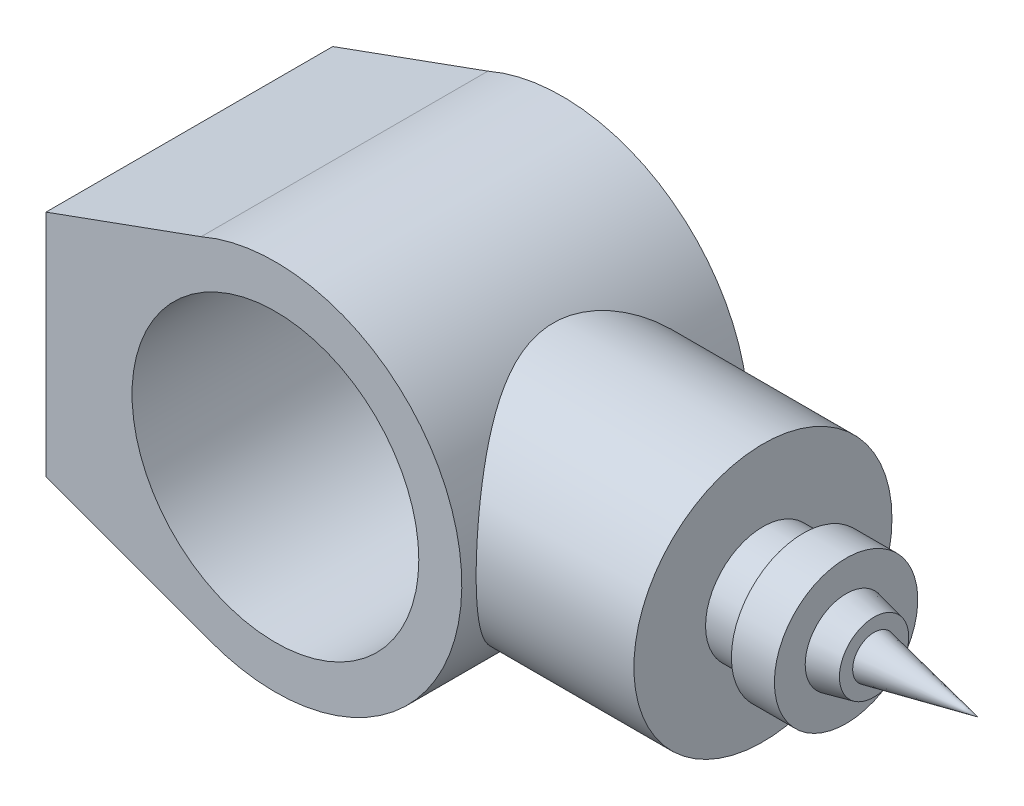
ISO-10303-21;
HEADER;
FILE_DESCRIPTION(('STEP AP214'),'2;1');
FILE_NAME('part.step','',(''),(''),'','','');
FILE_SCHEMA(('AUTOMOTIVE_DESIGN { 1 0 10303 214 1 1 1 1 }'));
ENDSEC;
DATA;
#1=APPLICATION_CONTEXT('core data for automotive mechanical design processes');
#2=APPLICATION_PROTOCOL_DEFINITION('international standard','automotive_design',2000,#1);
#3=PRODUCT_CONTEXT('',#1,'mechanical');
#4=PRODUCT('Part','Part','',(#3));
#5=PRODUCT_RELATED_PRODUCT_CATEGORY('part','',(#4));
#6=PRODUCT_DEFINITION_FORMATION('','',#4);
#7=PRODUCT_DEFINITION_CONTEXT('part definition',#1,'design');
#8=PRODUCT_DEFINITION('design','',#6,#7);
#9=PRODUCT_DEFINITION_SHAPE('','',#8);
#10=(LENGTH_UNIT() NAMED_UNIT(*) SI_UNIT(.MILLI.,.METRE.));
#11=(NAMED_UNIT(*) PLANE_ANGLE_UNIT() SI_UNIT($,.RADIAN.));
#12=(NAMED_UNIT(*) SI_UNIT($,.STERADIAN.) SOLID_ANGLE_UNIT());
#13=UNCERTAINTY_MEASURE_WITH_UNIT(LENGTH_MEASURE(1.E-05),#10,'distance_accuracy_value','');
#14=(GEOMETRIC_REPRESENTATION_CONTEXT(3) GLOBAL_UNCERTAINTY_ASSIGNED_CONTEXT((#13)) GLOBAL_UNIT_ASSIGNED_CONTEXT((#10,
#11,#12)) REPRESENTATION_CONTEXT('',''));
#15=CARTESIAN_POINT('',(0.,0.,0.));
#16=DIRECTION('',(0.,0.,1.));
#17=DIRECTION('',(1.,0.,0.));
#18=AXIS2_PLACEMENT_3D('',#15,#16,#17);
#19=CARTESIAN_POINT('',(0.,0.,50.));
#20=DIRECTION('',(0.,0.,1.));
#21=DIRECTION('',(1.,0.,0.));
#22=AXIS2_PLACEMENT_3D('',#19,#20,#21);
#23=PLANE('',#22);
#24=DIRECTION('',(-0.94010876807372,-0.340874616524774,0.));
#25=VECTOR('',#24,1.);
#26=CARTESIAN_POINT('',(-80.,40.,50.));
#27=LINE('',#26,#25);
#28=CARTESIAN_POINT('',(-25.9121645886203,59.6117415140025,50.));
#29=VERTEX_POINT('',#28);
#30=CARTESIAN_POINT('',(-80.,40.,50.));
#31=VERTEX_POINT('',#30);
#32=EDGE_CURVE('E179',#29,#31,#27,.T.);
#33=ORIENTED_EDGE('',*,*,#32,.T.);
#34=DIRECTION('',(0.,-1.,0.));
#35=VECTOR('',#34,1.);
#36=CARTESIAN_POINT('',(-80.,-40.,50.));
#37=LINE('',#36,#35);
#38=CARTESIAN_POINT('',(-80.,-40.,50.));
#39=VERTEX_POINT('',#38);
#40=EDGE_CURVE('E81',#31,#39,#37,.T.);
#41=ORIENTED_EDGE('',*,*,#40,.T.);
#42=DIRECTION('',(0.939431565550324,-0.342736536785424,0.));
#43=VECTOR('',#42,1.);
#44=CARTESIAN_POINT('',(-80.,-40.,50.));
#45=LINE('',#44,#43);
#46=CARTESIAN_POINT('',(-22.9380914935134,-60.8181219591267,50.));
#47=VERTEX_POINT('',#46);
#48=EDGE_CURVE('E175',#39,#47,#45,.T.);
#49=ORIENTED_EDGE('',*,*,#48,.T.);
#50=CARTESIAN_POINT('',(0.,0.,50.));
#51=DIRECTION('',(0.,0.,1.));
#52=DIRECTION('',(1.,0.,0.));
#53=AXIS2_PLACEMENT_3D('',#50,#51,#52);
#54=CIRCLE('',#53,65.);
#55=EDGE_CURVE('E50',#47,#29,#54,.T.);
#56=ORIENTED_EDGE('',*,*,#55,.T.);
#57=EDGE_LOOP('',(#33,#41,#49,#56));
#58=FACE_BOUND('',#57,.T.);
#59=CARTESIAN_POINT('',(0.,0.,50.));
#60=DIRECTION('',(0.,0.,1.));
#61=DIRECTION('',(1.,0.,0.));
#62=AXIS2_PLACEMENT_3D('',#59,#60,#61);
#63=CIRCLE('',#62,50.);
#64=CARTESIAN_POINT('',(50.,0.,50.));
#65=VERTEX_POINT('',#64);
#66=EDGE_CURVE('E189',#65,#65,#63,.T.);
#67=ORIENTED_EDGE('',*,*,#66,.F.);
#68=EDGE_LOOP('',(#67));
#69=FACE_BOUND('',#68,.T.);
#70=ADVANCED_FACE('F33',(#58,#69),#23,.T.);
#71=CARTESIAN_POINT('',(0.,0.,-50.));
#72=DIRECTION('',(0.,0.,1.));
#73=DIRECTION('',(1.,0.,0.));
#74=AXIS2_PLACEMENT_3D('',#71,#72,#73);
#75=PLANE('',#74);
#76=DIRECTION('',(-0.94010876807372,-0.340874616524774,0.));
#77=VECTOR('',#76,1.);
#78=CARTESIAN_POINT('',(-80.,40.,-50.));
#79=LINE('',#78,#77);
#80=CARTESIAN_POINT('',(-25.9121645886203,59.6117415140025,-50.));
#81=VERTEX_POINT('',#80);
#82=CARTESIAN_POINT('',(-80.,40.,-50.));
#83=VERTEX_POINT('',#82);
#84=EDGE_CURVE('E173',#81,#83,#79,.T.);
#85=ORIENTED_EDGE('',*,*,#84,.F.);
#86=CARTESIAN_POINT('',(0.,0.,-50.));
#87=DIRECTION('',(0.,0.,1.));
#88=DIRECTION('',(1.,0.,0.));
#89=AXIS2_PLACEMENT_3D('',#86,#87,#88);
#90=CIRCLE('',#89,65.);
#91=CARTESIAN_POINT('',(-22.9380914935134,-60.8181219591267,-50.));
#92=VERTEX_POINT('',#91);
#93=EDGE_CURVE('E74',#92,#81,#90,.T.);
#94=ORIENTED_EDGE('',*,*,#93,.F.);
#95=DIRECTION('',(0.939431565550324,-0.342736536785424,0.));
#96=VECTOR('',#95,1.);
#97=CARTESIAN_POINT('',(-80.,-40.,-50.));
#98=LINE('',#97,#96);
#99=CARTESIAN_POINT('',(-80.,-40.,-50.));
#100=VERTEX_POINT('',#99);
#101=EDGE_CURVE('E68',#100,#92,#98,.T.);
#102=ORIENTED_EDGE('',*,*,#101,.F.);
#103=DIRECTION('',(0.,-1.,0.));
#104=VECTOR('',#103,1.);
#105=CARTESIAN_POINT('',(-80.,-40.,-50.));
#106=LINE('',#105,#104);
#107=EDGE_CURVE('E168',#83,#100,#106,.T.);
#108=ORIENTED_EDGE('',*,*,#107,.F.);
#109=EDGE_LOOP('',(#85,#94,#102,#108));
#110=FACE_BOUND('',#109,.T.);
#111=CARTESIAN_POINT('',(0.,0.,-50.));
#112=DIRECTION('',(0.,0.,1.));
#113=DIRECTION('',(1.,0.,0.));
#114=AXIS2_PLACEMENT_3D('',#111,#112,#113);
#115=CIRCLE('',#114,50.);
#116=CARTESIAN_POINT('',(50.,0.,-50.));
#117=VERTEX_POINT('',#116);
#118=EDGE_CURVE('E191',#117,#117,#115,.T.);
#119=ORIENTED_EDGE('',*,*,#118,.T.);
#120=EDGE_LOOP('',(#119));
#121=FACE_BOUND('',#120,.T.);
#122=ADVANCED_FACE('F148',(#110,#121),#75,.F.);
#123=CARTESIAN_POINT('',(-80.,40.,50.));
#124=DIRECTION('',(0.340874616524774,-0.940108768073721,0.));
#125=DIRECTION('',(0.94010876807372,0.340874616524774,0.));
#126=AXIS2_PLACEMENT_3D('',#123,#124,#125);
#127=PLANE('',#126);
#128=ORIENTED_EDGE('',*,*,#84,.T.);
#129=DIRECTION('',(0.,0.,-1.));
#130=VECTOR('',#129,1.);
#131=CARTESIAN_POINT('',(-80.,40.,50.));
#132=LINE('',#131,#130);
#133=EDGE_CURVE('E11',#31,#83,#132,.T.);
#134=ORIENTED_EDGE('',*,*,#133,.F.);
#135=ORIENTED_EDGE('',*,*,#32,.F.);
#136=DIRECTION('',(0.,0.,-1.));
#137=VECTOR('',#136,1.);
#138=CARTESIAN_POINT('',(-25.9121645886203,59.6117415140025,50.));
#139=LINE('',#138,#137);
#140=EDGE_CURVE('E183',#29,#81,#139,.T.);
#141=ORIENTED_EDGE('',*,*,#140,.T.);
#142=EDGE_LOOP('',(#128,#134,#135,#141));
#143=FACE_BOUND('',#142,.T.);
#144=ADVANCED_FACE('F35',(#143),#127,.F.);
#145=CARTESIAN_POINT('',(-80.,-40.,50.));
#146=DIRECTION('',(1.,0.,0.));
#147=DIRECTION('',(0.,1.,0.));
#148=AXIS2_PLACEMENT_3D('',#145,#146,#147);
#149=PLANE('',#148);
#150=ORIENTED_EDGE('',*,*,#107,.T.);
#151=DIRECTION('',(0.,0.,-1.));
#152=VECTOR('',#151,1.);
#153=CARTESIAN_POINT('',(-80.,-40.,50.));
#154=LINE('',#153,#152);
#155=EDGE_CURVE('E42',#39,#100,#154,.T.);
#156=ORIENTED_EDGE('',*,*,#155,.F.);
#157=ORIENTED_EDGE('',*,*,#40,.F.);
#158=ORIENTED_EDGE('',*,*,#133,.T.);
#159=EDGE_LOOP('',(#150,#156,#157,#158));
#160=FACE_BOUND('',#159,.T.);
#161=ADVANCED_FACE('F162',(#160),#149,.F.);
#162=CARTESIAN_POINT('',(-80.,-40.,50.));
#163=DIRECTION('',(0.342736536785424,0.939431565550324,0.));
#164=DIRECTION('',(-0.939431565550324,0.342736536785424,0.));
#165=AXIS2_PLACEMENT_3D('',#162,#163,#164);
#166=PLANE('',#165);
#167=ORIENTED_EDGE('',*,*,#101,.T.);
#168=DIRECTION('',(0.,0.,-1.));
#169=VECTOR('',#168,1.);
#170=CARTESIAN_POINT('',(-22.9380914935134,-60.8181219591267,50.));
#171=LINE('',#170,#169);
#172=EDGE_CURVE('E176',#47,#92,#171,.T.);
#173=ORIENTED_EDGE('',*,*,#172,.F.);
#174=ORIENTED_EDGE('',*,*,#48,.F.);
#175=ORIENTED_EDGE('',*,*,#155,.T.);
#176=EDGE_LOOP('',(#167,#173,#174,#175));
#177=FACE_BOUND('',#176,.T.);
#178=ADVANCED_FACE('F159',(#177),#166,.F.);
#179=CARTESIAN_POINT('',(0.,0.,50.));
#180=DIRECTION('',(0.,0.,-1.));
#181=DIRECTION('',(-1.,0.,0.));
#182=AXIS2_PLACEMENT_3D('',#179,#180,#181);
#183=CYLINDRICAL_SURFACE('',#182,65.);
#184=CARTESIAN_POINT('',(65.,0.,-45.));
#185=CARTESIAN_POINT('',(65.0000011696057,1.12147330120565,-45.0000012025283));
#186=CARTESIAN_POINT('',(64.9709159765212,2.24292945230778,-44.9580201602482));
#187=CARTESIAN_POINT('',(64.8553068641383,4.47658414079082,-44.790785609369));
#188=CARTESIAN_POINT('',(64.7687842573088,5.58878288911931,-44.6655340035371));
#189=CARTESIAN_POINT('',(64.5403785763001,7.79555151848628,-44.3336771879691));
#190=CARTESIAN_POINT('',(64.3984760503456,8.89011506447751,-44.1270433931238));
#191=CARTESIAN_POINT('',(64.0626457436966,11.0533096019768,-43.6354760134034));
#192=CARTESIAN_POINT('',(63.8687169569864,12.1219400915896,-43.3505409144375));
#193=CARTESIAN_POINT('',(63.4342222744662,14.2212125160505,-42.7078017297046));
#194=CARTESIAN_POINT('',(63.1938918545645,15.2520162370063,-42.3503651251477));
#195=CARTESIAN_POINT('',(62.6709259446924,17.2756280115286,-41.5659763086892));
#196=CARTESIAN_POINT('',(62.3882907364915,18.268436318107,-41.1390245597888));
#197=CARTESIAN_POINT('',(61.786108553932,20.2116697228795,-40.2199419970838));
#198=CARTESIAN_POINT('',(61.4665619062631,21.1620951960855,-39.7278117601444));
#199=CARTESIAN_POINT('',(60.7962171584065,23.0172309124314,-38.6825647509799));
#200=CARTESIAN_POINT('',(60.4454175300334,23.9219389167185,-38.1294449962195));
#201=CARTESIAN_POINT('',(59.6865648974474,25.7601880140228,-36.9151737617935));
#202=CARTESIAN_POINT('',(59.27618815402,26.6893215363404,-36.2488040005491));
#203=CARTESIAN_POINT('',(58.4330275057249,28.4880338622967,-34.8529502059224));
#204=CARTESIAN_POINT('',(58.0002425478181,29.3576098626539,-34.1234632053608));
#205=CARTESIAN_POINT('',(57.1195111836477,31.0364486388513,-32.6040251352403));
#206=CARTESIAN_POINT('',(56.6715447181891,31.8456267033451,-31.8139921794123));
#207=CARTESIAN_POINT('',(55.7691986061138,33.4006700551814,-30.1773036556993));
#208=CARTESIAN_POINT('',(55.3148185876119,34.1465316534289,-29.3306447936721));
#209=CARTESIAN_POINT('',(54.3303114345595,35.6959084068904,-27.4326466159468));
#210=CARTESIAN_POINT('',(53.8005937511269,36.4872853280241,-26.3711450656527));
#211=CARTESIAN_POINT('',(52.7593327891933,37.9773509509911,-24.17604025639));
#212=CARTESIAN_POINT('',(52.2477941160227,38.6760162868262,-23.0424189272517));
#213=CARTESIAN_POINT('',(51.2608149265043,39.9749077721744,-20.7072341856928));
#214=CARTESIAN_POINT('',(50.7853275075273,40.5752630453964,-19.5057627267967));
#215=CARTESIAN_POINT('',(49.8892399163793,41.6721166930025,-17.036931864064));
#216=CARTESIAN_POINT('',(49.4686114171658,42.1686687478853,-15.7696069409943));
#217=CARTESIAN_POINT('',(48.8208029416879,42.9149535309565,-13.5723996352816));
#218=CARTESIAN_POINT('',(48.5738420263557,43.1936925213245,-12.6581208440976));
#219=CARTESIAN_POINT('',(48.1238801744123,43.6944569649788,-10.8035389223551));
#220=CARTESIAN_POINT('',(47.9208721021929,43.9164916250901,-9.86324004407419));
#221=CARTESIAN_POINT('',(47.5660754926548,44.3005296261305,-7.96250438663409));
#222=CARTESIAN_POINT('',(47.4142038087044,44.4626304606427,-7.00210302149487));
#223=CARTESIAN_POINT('',(47.1671263845177,44.7246555122386,-5.06554052628518));
#224=CARTESIAN_POINT('',(47.0719206259529,44.824579749433,-4.08937940131224));
#225=CARTESIAN_POINT('',(46.9418899090943,44.9607388198673,-2.1232364847967));
#226=CARTESIAN_POINT('',(46.9073939345417,44.9966266570423,-1.13320851844658));
#227=CARTESIAN_POINT('',(46.9013571135476,45.0029190462422,0.847248377093852));
#228=CARTESIAN_POINT('',(46.9298161498631,44.9733237202183,1.837677305534));
#229=CARTESIAN_POINT('',(47.0484302849821,44.8492190899201,3.81128752429081));
#230=CARTESIAN_POINT('',(47.13862305521,44.7546701492421,4.79446401850661));
#231=CARTESIAN_POINT('',(47.3768313176079,44.5024241630868,6.74551496467455));
#232=CARTESIAN_POINT('',(47.5248480621437,44.3447257499009,7.71338908473168));
#233=CARTESIAN_POINT('',(47.8621764271841,43.9803320764262,9.56919366964684));
#234=CARTESIAN_POINT('',(48.0484149088864,43.7772163066585,10.4583970625519));
#235=CARTESIAN_POINT('',(48.4609441046406,43.32010640119,12.2144143492181));
#236=CARTESIAN_POINT('',(48.6872496045115,43.0660934784815,13.0812198417583));
#237=CARTESIAN_POINT('',(49.1738509640383,42.5096331932465,14.7898225666927));
#238=CARTESIAN_POINT('',(49.4341648638834,42.2071601049958,15.6316062329481));
#239=CARTESIAN_POINT('',(49.9825182796335,41.5563350032134,17.2876417419013));
#240=CARTESIAN_POINT('',(50.2705534011697,41.2079902580444,18.1018979206949));
#241=CARTESIAN_POINT('',(51.0225431471345,40.2767822129268,20.1137766396802));
#242=CARTESIAN_POINT('',(51.5007434523328,39.6654891440572,21.2930273345177));
#243=CARTESIAN_POINT('',(52.4891158781477,38.348029920852,23.5833678403921));
#244=CARTESIAN_POINT('',(52.9993005340589,37.6418264436726,24.6944305853524));
#245=CARTESIAN_POINT('',(54.0361557973494,36.1376496350166,26.8476775780095));
#246=CARTESIAN_POINT('',(54.5628535785461,35.3395185623559,27.8897384505711));
#247=CARTESIAN_POINT('',(55.6171804467178,33.6558443419671,29.8998791095632));
#248=CARTESIAN_POINT('',(56.1448094104418,32.7703120184234,30.8679680307498));
#249=CARTESIAN_POINT('',(57.1932449701135,30.9045304086319,32.7363921475659));
#250=CARTESIAN_POINT('',(57.7139191350983,29.9233731295192,33.6358963165067));
#251=CARTESIAN_POINT('',(58.7296419536465,27.8771206485979,35.350355349792));
#252=CARTESIAN_POINT('',(59.2246882700661,26.8120178135979,36.1653025097018));
#253=CARTESIAN_POINT('',(60.1756566955639,24.6035209522421,37.7024332048813));
#254=CARTESIAN_POINT('',(60.6316475651595,23.4602711709794,38.4247809320632));
#255=CARTESIAN_POINT('',(61.4931891608211,21.0989507187335,39.7703323765769));
#256=CARTESIAN_POINT('',(61.898755017873,19.8809026570889,40.3935658507715));
#257=CARTESIAN_POINT('',(62.5646802947783,17.6549035875762,41.4059204565395));
#258=CARTESIAN_POINT('',(62.8372982548467,16.6602403417733,41.8163120535009));
#259=CARTESIAN_POINT('',(63.3397164077328,14.6345031625144,42.5675669112335));
#260=CARTESIAN_POINT('',(63.569522535998,13.603434299959,42.9084398107234));
#261=CARTESIAN_POINT('',(63.9815049902596,11.5110112910016,43.5164676119118));
#262=CARTESIAN_POINT('',(64.1637052650743,10.4496726714621,43.7836595836378));
#263=CARTESIAN_POINT('',(64.476639865795,8.30296993183371,44.2409869387356));
#264=CARTESIAN_POINT('',(64.6073730982257,7.21760530180254,44.431120684921));
#265=CARTESIAN_POINT('',(64.8147345736682,5.02649787175023,44.7321113931983));
#266=CARTESIAN_POINT('',(64.8911534961694,3.92069290489763,44.8426616714377));
#267=CARTESIAN_POINT('',(64.9872183357685,1.70145350776208,44.981563734156));
#268=CARTESIAN_POINT('',(65.0068642771874,0.588019080747696,45.0099155538474));
#269=CARTESIAN_POINT('',(64.9889001241945,-1.63741781931566,44.9839662509349));
#270=CARTESIAN_POINT('',(64.9512898349751,-2.74942028747967,44.929664847113));
#271=CARTESIAN_POINT('',(64.819734418053,-4.96298947367603,44.7392747901952));
#272=CARTESIAN_POINT('',(64.7257910494465,-6.06455651648127,44.6031886909653));
#273=CARTESIAN_POINT('',(64.491175703309,-8.18254449212149,44.2620157992034));
#274=CARTESIAN_POINT('',(64.3536808680178,-9.20007959997774,44.0616107864454));
#275=CARTESIAN_POINT('',(64.0337856060908,-11.2121337136589,43.5930613516679));
#276=CARTESIAN_POINT('',(63.8513873855499,-12.2066538475799,43.3249202574929));
#277=CARTESIAN_POINT('',(63.4451725249075,-14.1673074608523,42.7239854011605));
#278=CARTESIAN_POINT('',(63.2213525684632,-15.1334386601223,42.3911864622047));
#279=CARTESIAN_POINT('',(62.736336352677,-17.0327019487273,41.6643868113868));
#280=CARTESIAN_POINT('',(62.4751380044848,-17.965832190203,41.2703826790343));
#281=CARTESIAN_POINT('',(61.8990085085122,-19.8637431772395,40.3931275129008));
#282=CARTESIAN_POINT('',(61.5815209528501,-20.8256806929253,39.9054081529014));
#283=CARTESIAN_POINT('',(60.9142086391395,-22.7035764997345,38.8677076181211));
#284=CARTESIAN_POINT('',(60.5643826081083,-23.6195329786528,38.3177239921568));
#285=CARTESIAN_POINT('',(59.8381347129401,-25.4032558353403,37.1592008079418));
#286=CARTESIAN_POINT('',(59.4616987975441,-26.270996314329,36.5506302507532));
#287=CARTESIAN_POINT('',(58.6884577670336,-27.9557544991496,35.2787474176625));
#288=CARTESIAN_POINT('',(58.2916515549571,-28.7727694681138,34.6154321925309));
#289=CARTESIAN_POINT('',(57.4151711853793,-30.4889708749912,33.1199200847161));
#290=CARTESIAN_POINT('',(56.9328754552547,-31.3785212006928,32.2781812569548));
#291=CARTESIAN_POINT('',(55.9590893109094,-33.0839042215169,30.5278352445589));
#292=CARTESIAN_POINT('',(55.4675975421249,-33.8997259516808,29.6192181500899));
#293=CARTESIAN_POINT('',(54.4860350387397,-35.45586994741,27.7375714933993));
#294=CARTESIAN_POINT('',(53.9959654596117,-36.1961418986443,26.7644997080007));
#295=CARTESIAN_POINT('',(53.0294834997435,-37.5978502361011,24.7568233036382));
#296=CARTESIAN_POINT('',(52.553069328415,-38.2592969946585,23.7222268074148));
#297=CARTESIAN_POINT('',(51.679941347726,-39.4291013564639,21.7149007388747));
#298=CARTESIAN_POINT('',(51.2803372484816,-39.9463152685162,20.7485884228094));
#299=CARTESIAN_POINT('',(50.5123974548912,-40.9130636661729,18.7705314851885));
#300=CARTESIAN_POINT('',(50.1440619804653,-41.3625976757848,17.7587865441704));
#301=CARTESIAN_POINT('',(49.4504928922364,-42.1893301292689,15.693797265063));
#302=CARTESIAN_POINT('',(49.1251906412473,-42.566644202947,14.6406225749502));
#303=CARTESIAN_POINT('',(48.5290098021012,-43.2451098617227,12.4950157035289));
#304=CARTESIAN_POINT('',(48.2581179989952,-43.5462799449171,11.4025931307277));
#305=CARTESIAN_POINT('',(47.8271610412375,-44.0186874861181,9.3921629994351));
#306=CARTESIAN_POINT('',(47.6558419905218,-44.2036946073207,8.47979353570419));
#307=CARTESIAN_POINT('',(47.3627606953031,-44.517583244497,6.63757582668245));
#308=CARTESIAN_POINT('',(47.2409923142224,-44.6464717105955,5.70772976070373));
#309=CARTESIAN_POINT('',(47.05166615705,-44.8459556683364,3.83718735816971));
#310=CARTESIAN_POINT('',(46.9840561376509,-44.9166073394187,2.89650236820514));
#311=CARTESIAN_POINT('',(46.9055698265682,-44.9985645522097,1.01014116515035));
#312=CARTESIAN_POINT('',(46.894694331428,-45.0098692606967,0.0644648821697862));
#313=CARTESIAN_POINT('',(46.9301408777119,-44.972908524549,-1.82506201386804));
#314=CARTESIAN_POINT('',(46.9764888551696,-44.9246160680299,-2.76891160474201));
#315=CARTESIAN_POINT('',(47.1245232303033,-44.7693052695385,-4.64731891289862));
#316=CARTESIAN_POINT('',(47.226209296244,-44.6622872796082,-5.58187668584874));
#317=CARTESIAN_POINT('',(47.4811423262629,-44.3911660407895,-7.43666598606561));
#318=CARTESIAN_POINT('',(47.634452919394,-44.2269923369625,-8.35687836049678));
#319=CARTESIAN_POINT('',(47.9871889035597,-43.8440109221367,-10.1768310643423));
#320=CARTESIAN_POINT('',(48.1866204648689,-43.6251959006593,-11.0765686368372));
#321=CARTESIAN_POINT('',(48.6908782922366,-43.0625185245671,-13.116726178063));
#322=CARTESIAN_POINT('',(49.0093972350599,-42.7008255731353,-14.2488681052183));
#323=CARTESIAN_POINT('',(49.699554494161,-41.8955268796886,-16.4668795226373));
#324=CARTESIAN_POINT('',(50.0712093704162,-41.4518955887103,-17.5527344499461));
#325=CARTESIAN_POINT('',(50.8544123719762,-40.4872212981013,-19.6760329984318));
#326=CARTESIAN_POINT('',(51.2660067549033,-39.9660881554129,-20.7134183727638));
#327=CARTESIAN_POINT('',(52.116211879306,-38.8508952329155,-22.7363587217865));
#328=CARTESIAN_POINT('',(52.5548209260535,-38.2568400254561,-23.7219169406072));
#329=CARTESIAN_POINT('',(53.4579357785502,-36.9847423381263,-25.6613286822633));
#330=CARTESIAN_POINT('',(53.9228021101371,-36.3051118639051,-26.6139712103077));
#331=CARTESIAN_POINT('',(54.8583333343946,-34.8753950985048,-28.4617532840731));
#332=CARTESIAN_POINT('',(55.3289982185488,-34.1253089107936,-29.3568929142368));
#333=CARTESIAN_POINT('',(56.2664339133503,-32.5564691651912,-31.0876310121466));
#334=CARTESIAN_POINT('',(56.7332035093429,-31.7376950080829,-31.923211478402));
#335=CARTESIAN_POINT('',(57.6535165855435,-30.033481652025,-33.5315189390535));
#336=CARTESIAN_POINT('',(58.1070588196762,-29.1480362003111,-34.3042400240121));
#337=CARTESIAN_POINT('',(59.0635284336244,-27.1643113596245,-35.9022819462667));
#338=CARTESIAN_POINT('',(59.5626106290919,-26.0547472869609,-36.7159606163356));
#339=CARTESIAN_POINT('',(60.5176757229357,-23.7521280348398,-38.2458641369291));
#340=CARTESIAN_POINT('',(60.9736519283074,-22.5590599397198,-38.962073861155));
#341=CARTESIAN_POINT('',(61.6149926579414,-20.7127348127311,-39.9558623322098));
#342=CARTESIAN_POINT('',(61.8215919655179,-20.088110583999,-40.2735888165198));
#343=CARTESIAN_POINT('',(62.2191547005856,-18.8206694867556,-40.8812436548858));
#344=CARTESIAN_POINT('',(62.4101203779565,-18.1778552539997,-41.1711760099034));
#345=CARTESIAN_POINT('',(62.7748527233683,-16.875283117665,-41.7219931318356));
#346=CARTESIAN_POINT('',(62.9486230408552,-16.2155288469421,-41.9828840638124));
#347=CARTESIAN_POINT('',(63.2775356475737,-14.8804011558233,-42.4744610119283));
#348=CARTESIAN_POINT('',(63.432679284421,-14.2050288695917,-42.7051492133046));
#349=CARTESIAN_POINT('',(63.8070721968101,-12.4447010544915,-43.25974494481));
#350=CARTESIAN_POINT('',(64.0114184468014,-11.3490405228654,-43.5602757498286));
#351=CARTESIAN_POINT('',(64.3654191982087,-9.12991345978806,-44.078827644396));
#352=CARTESIAN_POINT('',(64.5150820049425,-8.00645117856259,-44.2968612637911));
#353=CARTESIAN_POINT('',(64.7559993187061,-5.74082253729113,-44.6470112993716));
#354=CARTESIAN_POINT('',(64.847297757104,-4.59867091062173,-44.7791923387443));
#355=CARTESIAN_POINT('',(64.9692976296881,-2.30434018473195,-44.9556862638234));
#356=CARTESIAN_POINT('',(64.9999987983895,-1.15216104160189,-44.999998764566));
#357=CARTESIAN_POINT('',(65.,0.,-45.));
#358=B_SPLINE_CURVE_WITH_KNOTS('',3,(#184,#185,#186,#187,#188,#189,#190,#191,#192,#193,#194,
#195,#196,#197,#198,#199,#200,#201,#202,#203,#204,#205,#206,#207,#208,#209,#210,#211,#212,#213,
#214,#215,#216,#217,#218,#219,#220,#221,#222,#223,#224,#225,#226,#227,#228,#229,#230,#231,#232,
#233,#234,#235,#236,#237,#238,#239,#240,#241,#242,#243,#244,#245,#246,#247,#248,#249,#250,#251,
#252,#253,#254,#255,#256,#257,#258,#259,#260,#261,#262,#263,#264,#265,#266,#267,#268,#269,#270,
#271,#272,#273,#274,#275,#276,#277,#278,#279,#280,#281,#282,#283,#284,#285,#286,#287,#288,#289,
#290,#291,#292,#293,#294,#295,#296,#297,#298,#299,#300,#301,#302,#303,#304,#305,#306,#307,#308,
#309,#310,#311,#312,#313,#314,#315,#316,#317,#318,#319,#320,#321,#322,#323,#324,#325,#326,#327,
#328,#329,#330,#331,#332,#333,#334,#335,#336,#337,#338,#339,#340,#341,#342,#343,#344,#345,#346,
#347,#348,#349,#350,#351,#352,#353,#354,#355,#356,#357),.UNSPECIFIED.,.T.,.F.,(4,2,2,2,2,2,2,2,
2,2,2,2,2,2,2,2,2,2,2,2,2,2,2,2,2,2,2,2,2,2,2,2,2,2,2,2,2,2,2,2,2,2,2,2,2,2,2,2,2,2,2,2,2,2,2,2,
2,2,2,2,2,2,2,2,2,2,2,2,2,2,2,2,2,2,2,2,2,2,2,2,2,2,2,2,2,2,4),(0.,3.36323892794144,
6.72640100710137,10.0907454360665,13.4551549250109,16.8029195613731,20.1506619010729,
23.4983746134034,26.8462511096753,30.4871649037346,34.1282499524345,37.7743494260164,
41.4206611917409,45.6939383064405,49.9682903731881,54.2369825353392,58.5034617073671,
61.4625138492405,64.4210852373372,67.3748225577202,70.3285589227263,73.2982527376573,
76.2679410220407,79.2394430998938,82.2110095388412,85.0011411726389,87.7923045951578,
90.584954683776,93.3771628083065,97.6064034875675,101.837312178738,106.075592113262,
110.313347816192,114.596218662803,118.879479402292,123.155037051935,127.429308626693,
130.755998382163,134.082226580387,137.406778235214,140.731400520075,144.068767009318,
147.406132068879,150.743508483461,154.080780688207,157.215791533369,160.350648386749,
163.485756334407,166.621039552604,169.990545063149,173.360183268584,176.73161428665,
180.103227050672,184.047902440152,187.993163521895,191.94103513809,195.888386692538,
199.385185586645,202.88200907258,206.373186157811,209.863514294626,212.700365177753,
215.536864625513,218.370624567028,221.204424293963,224.039508887241,226.874576485218,
229.713151272815,232.55210603787,236.23803941247,239.925124033801,243.616531168718,
247.307706963636,251.081871120678,254.856029735252,258.631324277359,262.406973327354,
266.792058434818,271.177823293658,273.368885604935,275.55963203795,277.749912517597,
279.940034437727,283.398420446896,286.856280978073,290.31153567335,293.766805506531),.UNSPECIFIED.);
#359=CARTESIAN_POINT('',(65.,0.,-45.));
#360=VERTEX_POINT('',#359);
#361=EDGE_CURVE('E114',#360,#360,#358,.T.);
#362=ORIENTED_EDGE('',*,*,#361,.F.);
#363=EDGE_LOOP('',(#362));
#364=FACE_BOUND('',#363,.T.);
#365=ORIENTED_EDGE('',*,*,#93,.T.);
#366=ORIENTED_EDGE('',*,*,#140,.F.);
#367=ORIENTED_EDGE('',*,*,#55,.F.);
#368=ORIENTED_EDGE('',*,*,#172,.T.);
#369=EDGE_LOOP('',(#365,#366,#367,#368));
#370=FACE_BOUND('',#369,.T.);
#371=ADVANCED_FACE('F145',(#364,#370),#183,.T.);
#372=CARTESIAN_POINT('',(0.,0.,50.));
#373=DIRECTION('',(0.,0.,-1.));
#374=DIRECTION('',(-1.,0.,0.));
#375=AXIS2_PLACEMENT_3D('',#372,#373,#374);
#376=CYLINDRICAL_SURFACE('',#375,50.);
#377=ORIENTED_EDGE('',*,*,#66,.T.);
#378=EDGE_LOOP('',(#377));
#379=FACE_BOUND('',#378,.T.);
#380=ORIENTED_EDGE('',*,*,#118,.F.);
#381=EDGE_LOOP('',(#380));
#382=FACE_BOUND('',#381,.T.);
#383=ADVANCED_FACE('F135',(#379,#382),#376,.F.);
#384=CARTESIAN_POINT('',(-80.002,0.,0.));
#385=DIRECTION('',(1.,0.,0.));
#386=DIRECTION('',(0.,0.,-1.));
#387=AXIS2_PLACEMENT_3D('',#384,#385,#386);
#388=CYLINDRICAL_SURFACE('',#387,45.);
#389=CARTESIAN_POINT('',(120.,0.,0.));
#390=DIRECTION('',(1.,0.,0.));
#391=DIRECTION('',(0.,0.,-1.));
#392=AXIS2_PLACEMENT_3D('',#389,#390,#391);
#393=CIRCLE('',#392,45.);
#394=CARTESIAN_POINT('',(120.,0.,-45.));
#395=VERTEX_POINT('',#394);
#396=EDGE_CURVE('E122',#395,#395,#393,.T.);
#397=ORIENTED_EDGE('',*,*,#396,.F.);
#398=EDGE_LOOP('',(#397));
#399=FACE_BOUND('',#398,.T.);
#400=ORIENTED_EDGE('',*,*,#361,.T.);
#401=EDGE_LOOP('',(#400));
#402=FACE_BOUND('',#401,.T.);
#403=ADVANCED_FACE('F124',(#399,#402),#388,.T.);
#404=CARTESIAN_POINT('',(120.,0.,0.));
#405=DIRECTION('',(1.,0.,0.));
#406=DIRECTION('',(0.,0.,-1.));
#407=AXIS2_PLACEMENT_3D('',#404,#405,#406);
#408=PLANE('',#407);
#409=CARTESIAN_POINT('',(120.,0.,0.));
#410=DIRECTION('',(-1.,0.,0.));
#411=DIRECTION('',(0.,0.,1.));
#412=AXIS2_PLACEMENT_3D('',#409,#410,#411);
#413=CIRCLE('',#412,20.);
#414=CARTESIAN_POINT('',(120.,0.,20.));
#415=VERTEX_POINT('',#414);
#416=EDGE_CURVE('E111',#415,#415,#413,.T.);
#417=ORIENTED_EDGE('',*,*,#416,.T.);
#418=EDGE_LOOP('',(#417));
#419=FACE_BOUND('',#418,.T.);
#420=ORIENTED_EDGE('',*,*,#396,.T.);
#421=EDGE_LOOP('',(#420));
#422=FACE_BOUND('',#421,.T.);
#423=ADVANCED_FACE('F132',(#419,#422),#408,.T.);
#424=CARTESIAN_POINT('',(0.,0.,0.));
#425=DIRECTION('',(-1.,0.,0.));
#426=DIRECTION('',(0.,0.,1.));
#427=AXIS2_PLACEMENT_3D('',#424,#425,#426);
#428=CYLINDRICAL_SURFACE('',#427,20.);
#429=CARTESIAN_POINT('',(134.,0.,0.));
#430=DIRECTION('',(-1.,0.,0.));
#431=DIRECTION('',(0.,0.,1.));
#432=AXIS2_PLACEMENT_3D('',#429,#430,#431);
#433=CIRCLE('',#432,20.);
#434=CARTESIAN_POINT('',(134.,0.,20.));
#435=VERTEX_POINT('',#434);
#436=EDGE_CURVE('E108',#435,#435,#433,.T.);
#437=ORIENTED_EDGE('',*,*,#436,.T.);
#438=EDGE_LOOP('',(#437));
#439=FACE_BOUND('',#438,.T.);
#440=ORIENTED_EDGE('',*,*,#416,.F.);
#441=EDGE_LOOP('',(#440));
#442=FACE_BOUND('',#441,.T.);
#443=ADVANCED_FACE('F130',(#439,#442),#428,.T.);
#444=CARTESIAN_POINT('',(134.,0.,20.));
#445=DIRECTION('',(-1.,0.,0.));
#446=DIRECTION('',(0.,0.,1.));
#447=AXIS2_PLACEMENT_3D('',#444,#445,#446);
#448=PLANE('',#447);
#449=CARTESIAN_POINT('',(134.,0.,0.));
#450=DIRECTION('',(-1.,0.,0.));
#451=DIRECTION('',(0.,0.,1.));
#452=AXIS2_PLACEMENT_3D('',#449,#450,#451);
#453=CIRCLE('',#452,25.);
#454=CARTESIAN_POINT('',(134.,0.,25.));
#455=VERTEX_POINT('',#454);
#456=EDGE_CURVE('E105',#455,#455,#453,.T.);
#457=ORIENTED_EDGE('',*,*,#456,.T.);
#458=EDGE_LOOP('',(#457));
#459=FACE_BOUND('',#458,.T.);
#460=ORIENTED_EDGE('',*,*,#436,.F.);
#461=EDGE_LOOP('',(#460));
#462=FACE_BOUND('',#461,.T.);
#463=ADVANCED_FACE('F140',(#459,#462),#448,.T.);
#464=CARTESIAN_POINT('',(0.,0.,0.));
#465=DIRECTION('',(-1.,0.,0.));
#466=DIRECTION('',(0.,0.,1.));
#467=AXIS2_PLACEMENT_3D('',#464,#465,#466);
#468=CYLINDRICAL_SURFACE('',#467,25.);
#469=CARTESIAN_POINT('',(149.,0.,0.));
#470=DIRECTION('',(-1.,0.,0.));
#471=DIRECTION('',(0.,0.,1.));
#472=AXIS2_PLACEMENT_3D('',#469,#470,#471);
#473=CIRCLE('',#472,25.);
#474=CARTESIAN_POINT('',(149.,0.,25.));
#475=VERTEX_POINT('',#474);
#476=EDGE_CURVE('E102',#475,#475,#473,.T.);
#477=ORIENTED_EDGE('',*,*,#476,.T.);
#478=EDGE_LOOP('',(#477));
#479=FACE_BOUND('',#478,.T.);
#480=ORIENTED_EDGE('',*,*,#456,.F.);
#481=EDGE_LOOP('',(#480));
#482=FACE_BOUND('',#481,.T.);
#483=ADVANCED_FACE('F257',(#479,#482),#468,.T.);
#484=CARTESIAN_POINT('',(149.,0.,25.));
#485=DIRECTION('',(1.,0.,0.));
#486=DIRECTION('',(0.,0.,-1.));
#487=AXIS2_PLACEMENT_3D('',#484,#485,#486);
#488=PLANE('',#487);
#489=CARTESIAN_POINT('',(149.,0.,0.));
#490=DIRECTION('',(-1.,0.,0.));
#491=DIRECTION('',(0.,0.,1.));
#492=AXIS2_PLACEMENT_3D('',#489,#490,#491);
#493=CIRCLE('',#492,14.2565566824256);
#494=CARTESIAN_POINT('',(149.,0.,14.2565566824256));
#495=VERTEX_POINT('',#494);
#496=EDGE_CURVE('E97',#495,#495,#493,.T.);
#497=ORIENTED_EDGE('',*,*,#496,.T.);
#498=EDGE_LOOP('',(#497));
#499=FACE_BOUND('',#498,.T.);
#500=ORIENTED_EDGE('',*,*,#476,.F.);
#501=EDGE_LOOP('',(#500));
#502=FACE_BOUND('',#501,.T.);
#503=ADVANCED_FACE('F265',(#499,#502),#488,.T.);
#504=CARTESIAN_POINT('',(149.,0.,0.));
#505=DIRECTION('',(-1.,0.,0.));
#506=DIRECTION('',(0.,0.,1.));
#507=AXIS2_PLACEMENT_3D('',#504,#505,#506);
#508=CONICAL_SURFACE('',#507,14.2565566824256,0.219054140124346);
#509=CARTESIAN_POINT('',(158.761034274002,0.,0.));
#510=DIRECTION('',(-1.,0.,0.));
#511=DIRECTION('',(0.,0.,1.));
#512=AXIS2_PLACEMENT_3D('',#509,#510,#511);
#513=CIRCLE('',#512,12.0834920488379);
#514=CARTESIAN_POINT('',(158.761034274002,0.,12.0834920488379));
#515=VERTEX_POINT('',#514);
#516=EDGE_CURVE('E94',#515,#515,#513,.T.);
#517=ORIENTED_EDGE('',*,*,#516,.T.);
#518=EDGE_LOOP('',(#517));
#519=FACE_BOUND('',#518,.T.);
#520=ORIENTED_EDGE('',*,*,#496,.F.);
#521=EDGE_LOOP('',(#520));
#522=FACE_BOUND('',#521,.T.);
#523=ADVANCED_FACE('F274',(#519,#522),#508,.T.);
#524=CARTESIAN_POINT('',(158.761034274002,0.,12.0834920488379));
#525=DIRECTION('',(1.,0.,0.));
#526=DIRECTION('',(0.,0.,-1.));
#527=AXIS2_PLACEMENT_3D('',#524,#525,#526);
#528=PLANE('',#527);
#529=CARTESIAN_POINT('',(158.761034274002,0.,0.));
#530=DIRECTION('',(-1.,0.,0.));
#531=DIRECTION('',(0.,0.,1.));
#532=AXIS2_PLACEMENT_3D('',#529,#530,#531);
#533=CIRCLE('',#532,7.4657459848279);
#534=CARTESIAN_POINT('',(158.761034274002,0.,7.4657459848279));
#535=VERTEX_POINT('',#534);
#536=EDGE_CURVE('E92',#535,#535,#533,.T.);
#537=ORIENTED_EDGE('',*,*,#536,.T.);
#538=EDGE_LOOP('',(#537));
#539=FACE_BOUND('',#538,.T.);
#540=ORIENTED_EDGE('',*,*,#516,.F.);
#541=EDGE_LOOP('',(#540));
#542=FACE_BOUND('',#541,.T.);
#543=ADVANCED_FACE('F88',(#539,#542),#528,.T.);
#544=CARTESIAN_POINT('',(158.761034274002,0.,0.));
#545=DIRECTION('',(-1.,0.,0.));
#546=DIRECTION('',(0.,0.,1.));
#547=AXIS2_PLACEMENT_3D('',#544,#545,#546);
#548=CONICAL_SURFACE('',#547,7.4657459848279,0.203171817450551);
#549=CARTESIAN_POINT('',(195.,0.,0.));
#550=VERTEX_POINT('',#549);
#551=VERTEX_LOOP('',#550);
#552=FACE_BOUND('',#551,.T.);
#553=ORIENTED_EDGE('',*,*,#536,.F.);
#554=EDGE_LOOP('',(#553));
#555=FACE_BOUND('',#554,.T.);
#556=ADVANCED_FACE('F85',(#552,#555),#548,.T.);
#557=CLOSED_SHELL('',(#70,#122,#144,#161,#178,#371,#383,#403,#423,#443,#463,#483,#503,#523,#543,#556));
#558=MANIFOLD_SOLID_BREP('B2',#557);
#559=ADVANCED_BREP_SHAPE_REPRESENTATION('',(#18,#558),#14);
#560=SHAPE_DEFINITION_REPRESENTATION(#9,#559);
ENDSEC;
END-ISO-10303-21;
